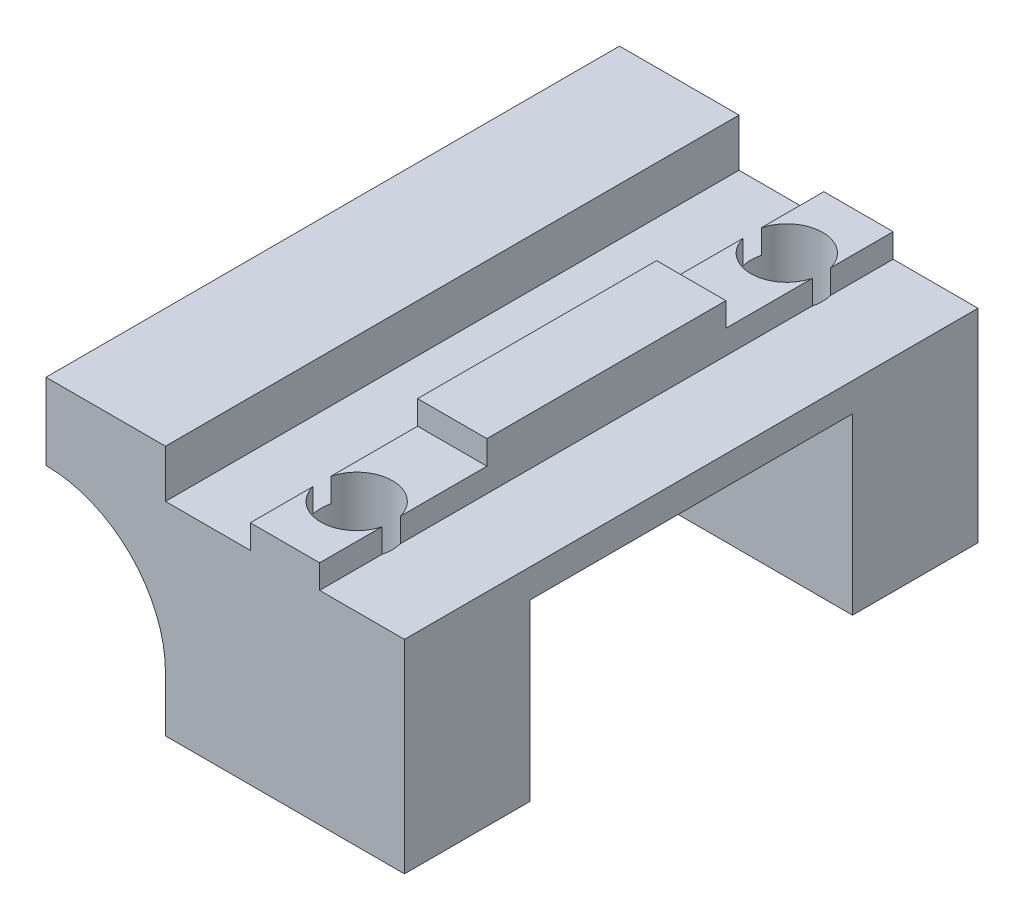
ISO-10303-21;
HEADER;
FILE_DESCRIPTION(('STEP AP214'),'2;1');
FILE_NAME('part.step','',(''),(''),'','','');
FILE_SCHEMA(('AUTOMOTIVE_DESIGN { 1 0 10303 214 1 1 1 1 }'));
ENDSEC;
DATA;
#1=APPLICATION_CONTEXT('core data for automotive mechanical design processes');
#2=APPLICATION_PROTOCOL_DEFINITION('international standard','automotive_design',2000,#1);
#3=PRODUCT_CONTEXT('',#1,'mechanical');
#4=PRODUCT('Part','Part','',(#3));
#5=PRODUCT_RELATED_PRODUCT_CATEGORY('part','',(#4));
#6=PRODUCT_DEFINITION_FORMATION('','',#4);
#7=PRODUCT_DEFINITION_CONTEXT('part definition',#1,'design');
#8=PRODUCT_DEFINITION('design','',#6,#7);
#9=PRODUCT_DEFINITION_SHAPE('','',#8);
#10=(LENGTH_UNIT() NAMED_UNIT(*) SI_UNIT(.MILLI.,.METRE.));
#11=(NAMED_UNIT(*) PLANE_ANGLE_UNIT() SI_UNIT($,.RADIAN.));
#12=(NAMED_UNIT(*) SI_UNIT($,.STERADIAN.) SOLID_ANGLE_UNIT());
#13=UNCERTAINTY_MEASURE_WITH_UNIT(LENGTH_MEASURE(1.E-05),#10,'distance_accuracy_value','');
#14=(GEOMETRIC_REPRESENTATION_CONTEXT(3) GLOBAL_UNCERTAINTY_ASSIGNED_CONTEXT((#13)) GLOBAL_UNIT_ASSIGNED_CONTEXT((#10,
#11,#12)) REPRESENTATION_CONTEXT('',''));
#15=CARTESIAN_POINT('',(0.,0.,0.));
#16=DIRECTION('',(0.,0.,1.));
#17=DIRECTION('',(1.,0.,0.));
#18=AXIS2_PLACEMENT_3D('',#15,#16,#17);
#19=CARTESIAN_POINT('',(-1.45,10.5,12.));
#20=DIRECTION('',(1.,0.,0.));
#21=DIRECTION('',(0.,1.,0.));
#22=AXIS2_PLACEMENT_3D('',#19,#20,#21);
#23=PLANE('',#22);
#24=DIRECTION('',(0.,0.,1.));
#25=VECTOR('',#24,1.);
#26=CARTESIAN_POINT('',(-1.45,9.5,-12.));
#27=LINE('',#26,#25);
#28=CARTESIAN_POINT('',(-1.45,9.5,-12.));
#29=VERTEX_POINT('',#28);
#30=CARTESIAN_POINT('',(-1.45,9.5,-9.38405728739343));
#31=VERTEX_POINT('',#30);
#32=EDGE_CURVE('E472',#29,#31,#27,.T.);
#33=ORIENTED_EDGE('',*,*,#32,.F.);
#34=DIRECTION('',(0.,-1.,0.));
#35=VECTOR('',#34,1.);
#36=CARTESIAN_POINT('',(-1.45,10.5,-12.));
#37=LINE('',#36,#35);
#38=CARTESIAN_POINT('',(-1.45,8.5,-12.));
#39=VERTEX_POINT('',#38);
#40=EDGE_CURVE('E293',#29,#39,#37,.T.);
#41=ORIENTED_EDGE('',*,*,#40,.T.);
#42=DIRECTION('',(0.,0.,-1.));
#43=VECTOR('',#42,1.);
#44=CARTESIAN_POINT('',(-1.45,8.5,12.));
#45=LINE('',#44,#43);
#46=CARTESIAN_POINT('',(-1.45,8.5,-9.38405728739343));
#47=VERTEX_POINT('',#46);
#48=EDGE_CURVE('E306',#47,#39,#45,.T.);
#49=ORIENTED_EDGE('',*,*,#48,.F.);
#50=DIRECTION('',(0.,1.,0.));
#51=VECTOR('',#50,1.);
#52=CARTESIAN_POINT('',(-1.45,0.,-9.38405728739343));
#53=LINE('',#52,#51);
#54=EDGE_CURVE('E420',#47,#31,#53,.T.);
#55=ORIENTED_EDGE('',*,*,#54,.T.);
#56=EDGE_LOOP('',(#33,#41,#49,#55));
#57=FACE_BOUND('',#56,.T.);
#58=ADVANCED_FACE('F33',(#57),#23,.F.);
#59=CARTESIAN_POINT('',(1.45,8.5,12.));
#60=DIRECTION('',(-1.,0.,0.));
#61=DIRECTION('',(0.,-1.,0.));
#62=AXIS2_PLACEMENT_3D('',#59,#60,#61);
#63=PLANE('',#62);
#64=DIRECTION('',(0.,0.,-1.));
#65=VECTOR('',#64,1.);
#66=CARTESIAN_POINT('',(1.45,9.5,-12.));
#67=LINE('',#66,#65);
#68=CARTESIAN_POINT('',(1.45,9.5,-9.38405728739343));
#69=VERTEX_POINT('',#68);
#70=CARTESIAN_POINT('',(1.45,9.5,-12.));
#71=VERTEX_POINT('',#70);
#72=EDGE_CURVE('E478',#69,#71,#67,.T.);
#73=ORIENTED_EDGE('',*,*,#72,.F.);
#74=DIRECTION('',(0.,1.,0.));
#75=VECTOR('',#74,1.);
#76=CARTESIAN_POINT('',(1.45,0.,-9.38405728739343));
#77=LINE('',#76,#75);
#78=CARTESIAN_POINT('',(1.45,8.5,-9.38405728739343));
#79=VERTEX_POINT('',#78);
#80=EDGE_CURVE('E423',#69,#79,#77,.F.);
#81=ORIENTED_EDGE('',*,*,#80,.T.);
#82=DIRECTION('',(0.,0.,-1.));
#83=VECTOR('',#82,1.);
#84=CARTESIAN_POINT('',(1.45,8.5,12.));
#85=LINE('',#84,#83);
#86=CARTESIAN_POINT('',(1.45,8.5,-12.));
#87=VERTEX_POINT('',#86);
#88=EDGE_CURVE('E313',#79,#87,#85,.T.);
#89=ORIENTED_EDGE('',*,*,#88,.T.);
#90=DIRECTION('',(0.,1.,0.));
#91=VECTOR('',#90,1.);
#92=CARTESIAN_POINT('',(1.45,8.5,-12.));
#93=LINE('',#92,#91);
#94=EDGE_CURVE('E290',#87,#71,#93,.T.);
#95=ORIENTED_EDGE('',*,*,#94,.T.);
#96=EDGE_LOOP('',(#73,#81,#89,#95));
#97=FACE_BOUND('',#96,.T.);
#98=ADVANCED_FACE('F549',(#97),#63,.F.);
#99=CARTESIAN_POINT('',(0.,0.,-12.));
#100=DIRECTION('',(0.,0.,1.));
#101=DIRECTION('',(1.,0.,0.));
#102=AXIS2_PLACEMENT_3D('',#99,#100,#101);
#103=PLANE('',#102);
#104=DIRECTION('',(-1.,0.,0.));
#105=VECTOR('',#104,1.);
#106=CARTESIAN_POINT('',(-1.45,9.5,-12.));
#107=LINE('',#106,#105);
#108=EDGE_CURVE('E481',#71,#29,#107,.T.);
#109=ORIENTED_EDGE('',*,*,#108,.F.);
#110=ORIENTED_EDGE('',*,*,#94,.F.);
#111=DIRECTION('',(-1.,0.,0.));
#112=VECTOR('',#111,1.);
#113=CARTESIAN_POINT('',(5.,8.5,-12.));
#114=LINE('',#113,#112);
#115=CARTESIAN_POINT('',(5.,8.5,-12.));
#116=VERTEX_POINT('',#115);
#117=EDGE_CURVE('E287',#116,#87,#114,.T.);
#118=ORIENTED_EDGE('',*,*,#117,.F.);
#119=DIRECTION('',(0.,1.,0.));
#120=VECTOR('',#119,1.);
#121=CARTESIAN_POINT('',(5.,0.,-12.));
#122=LINE('',#121,#120);
#123=CARTESIAN_POINT('',(5.,0.,-12.));
#124=VERTEX_POINT('',#123);
#125=EDGE_CURVE('E284',#124,#116,#122,.T.);
#126=ORIENTED_EDGE('',*,*,#125,.F.);
#127=DIRECTION('',(1.,0.,0.));
#128=VECTOR('',#127,1.);
#129=CARTESIAN_POINT('',(-5.,0.,-12.));
#130=LINE('',#129,#128);
#131=CARTESIAN_POINT('',(-5.,0.,-12.));
#132=VERTEX_POINT('',#131);
#133=EDGE_CURVE('E281',#132,#124,#130,.T.);
#134=ORIENTED_EDGE('',*,*,#133,.F.);
#135=DIRECTION('',(0.,-1.,0.));
#136=VECTOR('',#135,1.);
#137=CARTESIAN_POINT('',(-5.,8.5,-12.));
#138=LINE('',#137,#136);
#139=CARTESIAN_POINT('',(-5.,2.3,-12.));
#140=VERTEX_POINT('',#139);
#141=EDGE_CURVE('E297',#140,#132,#138,.T.);
#142=ORIENTED_EDGE('',*,*,#141,.F.);
#143=CARTESIAN_POINT('',(-10.,2.3,-12.));
#144=DIRECTION('',(0.,0.,1.));
#145=DIRECTION('',(1.,0.,0.));
#146=AXIS2_PLACEMENT_3D('',#143,#144,#145);
#147=CIRCLE('',#146,5.);
#148=CARTESIAN_POINT('',(-10.,7.3,-12.));
#149=VERTEX_POINT('',#148);
#150=EDGE_CURVE('E342',#140,#149,#147,.T.);
#151=ORIENTED_EDGE('',*,*,#150,.T.);
#152=DIRECTION('',(0.,-1.,0.));
#153=VECTOR('',#152,1.);
#154=CARTESIAN_POINT('',(-10.,35.0153013442625,-12.));
#155=LINE('',#154,#153);
#156=CARTESIAN_POINT('',(-10.,10.5,-12.));
#157=VERTEX_POINT('',#156);
#158=EDGE_CURVE('E351',#157,#149,#155,.T.);
#159=ORIENTED_EDGE('',*,*,#158,.F.);
#160=DIRECTION('',(-1.,0.,0.));
#161=VECTOR('',#160,1.);
#162=CARTESIAN_POINT('',(-5.00000000000001,10.5,-12.));
#163=LINE('',#162,#161);
#164=CARTESIAN_POINT('',(-5.,10.5,-12.));
#165=VERTEX_POINT('',#164);
#166=EDGE_CURVE('E521',#165,#157,#163,.T.);
#167=ORIENTED_EDGE('',*,*,#166,.F.);
#168=DIRECTION('',(0.,-1.,0.));
#169=VECTOR('',#168,1.);
#170=CARTESIAN_POINT('',(-5.00000000000001,35.0153013442625,-12.));
#171=LINE('',#170,#169);
#172=CARTESIAN_POINT('',(-5.,8.5,-12.));
#173=VERTEX_POINT('',#172);
#174=EDGE_CURVE('E365',#165,#173,#171,.T.);
#175=ORIENTED_EDGE('',*,*,#174,.T.);
#176=DIRECTION('',(-1.,0.,0.));
#177=VECTOR('',#176,1.);
#178=CARTESIAN_POINT('',(-1.45,8.5,-12.));
#179=LINE('',#178,#177);
#180=EDGE_CURVE('E295',#39,#173,#179,.T.);
#181=ORIENTED_EDGE('',*,*,#180,.F.);
#182=ORIENTED_EDGE('',*,*,#40,.F.);
#183=EDGE_LOOP('',(#109,#110,#118,#126,#134,#142,#151,#159,#167,#175,#181,#182));
#184=FACE_BOUND('',#183,.T.);
#185=ADVANCED_FACE('F349',(#184),#103,.F.);
#186=CARTESIAN_POINT('',(0.,0.,-9.));
#187=DIRECTION('',(0.,1.,0.));
#188=DIRECTION('',(0.,0.,1.));
#189=AXIS2_PLACEMENT_3D('',#186,#187,#188);
#190=CYLINDRICAL_SURFACE('',#189,1.5);
#191=CARTESIAN_POINT('',(0.,0.,-9.));
#192=DIRECTION('',(0.,1.,0.));
#193=DIRECTION('',(0.,0.,1.));
#194=AXIS2_PLACEMENT_3D('',#191,#192,#193);
#195=CIRCLE('',#194,1.5);
#196=CARTESIAN_POINT('',(0.,0.,-7.5));
#197=VERTEX_POINT('',#196);
#198=EDGE_CURVE('E410',#197,#197,#195,.T.);
#199=ORIENTED_EDGE('',*,*,#198,.F.);
#200=EDGE_LOOP('',(#199));
#201=FACE_BOUND('',#200,.T.);
#202=CARTESIAN_POINT('',(0.,9.5,-9.));
#203=DIRECTION('',(0.,1.,0.));
#204=DIRECTION('',(0.,0.,1.));
#205=AXIS2_PLACEMENT_3D('',#202,#203,#204);
#206=CIRCLE('',#205,1.5);
#207=EDGE_CURVE('E333',#31,#69,#206,.F.);
#208=ORIENTED_EDGE('',*,*,#207,.F.);
#209=ORIENTED_EDGE('',*,*,#54,.F.);
#210=CARTESIAN_POINT('',(0.,8.5,-9.));
#211=DIRECTION('',(0.,-1.,0.));
#212=DIRECTION('',(1.,0.,0.));
#213=AXIS2_PLACEMENT_3D('',#210,#211,#212);
#214=CIRCLE('',#213,1.5);
#215=CARTESIAN_POINT('',(-1.45,8.5,-8.61594271260657));
#216=VERTEX_POINT('',#215);
#217=EDGE_CURVE('E328',#216,#47,#214,.T.);
#218=ORIENTED_EDGE('',*,*,#217,.F.);
#219=DIRECTION('',(0.,1.,0.));
#220=VECTOR('',#219,1.);
#221=CARTESIAN_POINT('',(-1.45,0.,-8.61594271260657));
#222=LINE('',#221,#220);
#223=CARTESIAN_POINT('',(-1.45,9.5,-8.61594271260657));
#224=VERTEX_POINT('',#223);
#225=EDGE_CURVE('E418',#224,#216,#222,.F.);
#226=ORIENTED_EDGE('',*,*,#225,.F.);
#227=CARTESIAN_POINT('',(1.45,9.5,-8.61594271260657));
#228=VERTEX_POINT('',#227);
#229=EDGE_CURVE('E331',#228,#224,#206,.F.);
#230=ORIENTED_EDGE('',*,*,#229,.F.);
#231=DIRECTION('',(0.,1.,0.));
#232=VECTOR('',#231,1.);
#233=CARTESIAN_POINT('',(1.45,0.,-8.61594271260657));
#234=LINE('',#233,#232);
#235=CARTESIAN_POINT('',(1.45,8.5,-8.61594271260657));
#236=VERTEX_POINT('',#235);
#237=EDGE_CURVE('E428',#236,#228,#234,.T.);
#238=ORIENTED_EDGE('',*,*,#237,.F.);
#239=CARTESIAN_POINT('',(0.,8.5,-9.));
#240=DIRECTION('',(0.,-1.,0.));
#241=DIRECTION('',(0.,0.,-1.));
#242=AXIS2_PLACEMENT_3D('',#239,#240,#241);
#243=CIRCLE('',#242,1.5);
#244=EDGE_CURVE('E425',#79,#236,#243,.T.);
#245=ORIENTED_EDGE('',*,*,#244,.F.);
#246=ORIENTED_EDGE('',*,*,#80,.F.);
#247=EDGE_LOOP('',(#208,#209,#218,#226,#230,#238,#245,#246));
#248=FACE_BOUND('',#247,.T.);
#249=ADVANCED_FACE('F545',(#201,#248),#190,.F.);
#250=CARTESIAN_POINT('',(-5.,8.5,12.));
#251=DIRECTION('',(1.,0.,0.));
#252=DIRECTION('',(0.,1.,0.));
#253=AXIS2_PLACEMENT_3D('',#250,#251,#252);
#254=PLANE('',#253);
#255=DIRECTION('',(0.,-1.,0.));
#256=VECTOR('',#255,1.);
#257=CARTESIAN_POINT('',(-5.,7.3,-6.75));
#258=LINE('',#257,#256);
#259=CARTESIAN_POINT('',(-5.,2.3,-6.75));
#260=VERTEX_POINT('',#259);
#261=CARTESIAN_POINT('',(-5.,0.,-6.75));
#262=VERTEX_POINT('',#261);
#263=EDGE_CURVE('E411',#260,#262,#258,.T.);
#264=ORIENTED_EDGE('',*,*,#263,.F.);
#265=DIRECTION('',(0.,0.,1.));
#266=VECTOR('',#265,1.);
#267=CARTESIAN_POINT('',(-5.,2.3,-12.));
#268=LINE('',#267,#266);
#269=EDGE_CURVE('E337',#260,#140,#268,.F.);
#270=ORIENTED_EDGE('',*,*,#269,.T.);
#271=ORIENTED_EDGE('',*,*,#141,.T.);
#272=DIRECTION('',(0.,0.,-1.));
#273=VECTOR('',#272,1.);
#274=CARTESIAN_POINT('',(-5.,0.,12.));
#275=LINE('',#274,#273);
#276=EDGE_CURVE('E280',#262,#132,#275,.T.);
#277=ORIENTED_EDGE('',*,*,#276,.F.);
#278=EDGE_LOOP('',(#264,#270,#271,#277));
#279=FACE_BOUND('',#278,.T.);
#280=ADVANCED_FACE('F563',(#279),#254,.F.);
#281=DIRECTION('',(0.,-1.,0.));
#282=VECTOR('',#281,1.);
#283=CARTESIAN_POINT('',(-5.,8.5,12.));
#284=LINE('',#283,#282);
#285=CARTESIAN_POINT('',(-5.,2.3,12.));
#286=VERTEX_POINT('',#285);
#287=CARTESIAN_POINT('',(-5.,0.,12.));
#288=VERTEX_POINT('',#287);
#289=EDGE_CURVE('E273',#286,#288,#284,.T.);
#290=ORIENTED_EDGE('',*,*,#289,.F.);
#291=DIRECTION('',(0.,0.,1.));
#292=VECTOR('',#291,1.);
#293=CARTESIAN_POINT('',(-5.,2.3,6.75));
#294=LINE('',#293,#292);
#295=CARTESIAN_POINT('',(-5.,2.3,6.75));
#296=VERTEX_POINT('',#295);
#297=EDGE_CURVE('E54',#286,#296,#294,.F.);
#298=ORIENTED_EDGE('',*,*,#297,.T.);
#299=DIRECTION('',(0.,-1.,0.));
#300=VECTOR('',#299,1.);
#301=CARTESIAN_POINT('',(-5.,7.3,6.75));
#302=LINE('',#301,#300);
#303=CARTESIAN_POINT('',(-5.,0.,6.75));
#304=VERTEX_POINT('',#303);
#305=EDGE_CURVE('E413',#296,#304,#302,.T.);
#306=ORIENTED_EDGE('',*,*,#305,.T.);
#307=EDGE_CURVE('E300',#288,#304,#275,.T.);
#308=ORIENTED_EDGE('',*,*,#307,.F.);
#309=EDGE_LOOP('',(#290,#298,#306,#308));
#310=FACE_BOUND('',#309,.T.);
#311=ADVANCED_FACE('F577',(#310),#254,.F.);
#312=CARTESIAN_POINT('',(-5.,0.,12.));
#313=DIRECTION('',(0.,1.,0.));
#314=DIRECTION('',(-1.,0.,0.));
#315=AXIS2_PLACEMENT_3D('',#312,#313,#314);
#316=PLANE('',#315);
#317=ORIENTED_EDGE('',*,*,#198,.T.);
#318=EDGE_LOOP('',(#317));
#319=FACE_BOUND('',#318,.T.);
#320=DIRECTION('',(0.,0.,-1.));
#321=VECTOR('',#320,1.);
#322=CARTESIAN_POINT('',(5.,0.,12.));
#323=LINE('',#322,#321);
#324=CARTESIAN_POINT('',(5.,0.,-6.75));
#325=VERTEX_POINT('',#324);
#326=EDGE_CURVE('E321',#325,#124,#323,.T.);
#327=ORIENTED_EDGE('',*,*,#326,.F.);
#328=DIRECTION('',(1.,0.,0.));
#329=VECTOR('',#328,1.);
#330=CARTESIAN_POINT('',(5.,0.,-6.75));
#331=LINE('',#330,#329);
#332=EDGE_CURVE('E398',#262,#325,#331,.T.);
#333=ORIENTED_EDGE('',*,*,#332,.F.);
#334=ORIENTED_EDGE('',*,*,#276,.T.);
#335=ORIENTED_EDGE('',*,*,#133,.T.);
#336=EDGE_LOOP('',(#327,#333,#334,#335));
#337=FACE_BOUND('',#336,.T.);
#338=ADVANCED_FACE('F558',(#319,#337),#316,.F.);
#339=DIRECTION('',(0.,0.,-1.));
#340=VECTOR('',#339,1.);
#341=CARTESIAN_POINT('',(1.45,10.5,12.));
#342=LINE('',#341,#340);
#343=CARTESIAN_POINT('',(1.45,10.5,5.));
#344=VERTEX_POINT('',#343);
#345=CARTESIAN_POINT('',(1.45,10.5,-5.));
#346=VERTEX_POINT('',#345);
#347=EDGE_CURVE('E311',#344,#346,#342,.T.);
#348=ORIENTED_EDGE('',*,*,#347,.F.);
#349=DIRECTION('',(0.,1.,0.));
#350=VECTOR('',#349,1.);
#351=CARTESIAN_POINT('',(1.45,9.5,5.));
#352=LINE('',#351,#350);
#353=CARTESIAN_POINT('',(1.45,9.5,5.));
#354=VERTEX_POINT('',#353);
#355=EDGE_CURVE('E463',#354,#344,#352,.T.);
#356=ORIENTED_EDGE('',*,*,#355,.F.);
#357=DIRECTION('',(0.,0.,-1.));
#358=VECTOR('',#357,1.);
#359=CARTESIAN_POINT('',(1.45,9.5,12.));
#360=LINE('',#359,#358);
#361=CARTESIAN_POINT('',(1.45,9.5,8.61594271260656));
#362=VERTEX_POINT('',#361);
#363=EDGE_CURVE('E265',#362,#354,#360,.T.);
#364=ORIENTED_EDGE('',*,*,#363,.F.);
#365=DIRECTION('',(0.,1.,0.));
#366=VECTOR('',#365,1.);
#367=CARTESIAN_POINT('',(1.45,0.,8.61594271260657));
#368=LINE('',#367,#366);
#369=CARTESIAN_POINT('',(1.45,8.5,8.61594271260657));
#370=VERTEX_POINT('',#369);
#371=EDGE_CURVE('E439',#362,#370,#368,.F.);
#372=ORIENTED_EDGE('',*,*,#371,.T.);
#373=EDGE_CURVE('E318',#370,#236,#85,.T.);
#374=ORIENTED_EDGE('',*,*,#373,.T.);
#375=ORIENTED_EDGE('',*,*,#237,.T.);
#376=CARTESIAN_POINT('',(1.45,9.5,-5.));
#377=VERTEX_POINT('',#376);
#378=EDGE_CURVE('E479',#377,#228,#67,.T.);
#379=ORIENTED_EDGE('',*,*,#378,.F.);
#380=DIRECTION('',(0.,1.,0.));
#381=VECTOR('',#380,1.);
#382=CARTESIAN_POINT('',(1.45,9.5,-5.));
#383=LINE('',#382,#381);
#384=EDGE_CURVE('E486',#377,#346,#383,.T.);
#385=ORIENTED_EDGE('',*,*,#384,.T.);
#386=EDGE_LOOP('',(#348,#356,#364,#372,#374,#375,#379,#385));
#387=FACE_BOUND('',#386,.T.);
#388=ADVANCED_FACE('F589',(#387),#63,.F.);
#389=CARTESIAN_POINT('',(1.45,10.5,12.));
#390=DIRECTION('',(0.,-1.,0.));
#391=DIRECTION('',(0.,0.,-1.));
#392=AXIS2_PLACEMENT_3D('',#389,#390,#391);
#393=PLANE('',#392);
#394=DIRECTION('',(0.,0.,-1.));
#395=VECTOR('',#394,1.);
#396=CARTESIAN_POINT('',(-1.45,10.5,12.));
#397=LINE('',#396,#395);
#398=CARTESIAN_POINT('',(-1.45,10.5,5.));
#399=VERTEX_POINT('',#398);
#400=CARTESIAN_POINT('',(-1.45,10.5,-5.));
#401=VERTEX_POINT('',#400);
#402=EDGE_CURVE('E308',#399,#401,#397,.T.);
#403=ORIENTED_EDGE('',*,*,#402,.F.);
#404=DIRECTION('',(-1.,0.,0.));
#405=VECTOR('',#404,1.);
#406=CARTESIAN_POINT('',(-1.45,10.5,5.));
#407=LINE('',#406,#405);
#408=EDGE_CURVE('E257',#344,#399,#407,.T.);
#409=ORIENTED_EDGE('',*,*,#408,.F.);
#410=ORIENTED_EDGE('',*,*,#347,.T.);
#411=DIRECTION('',(1.,0.,0.));
#412=VECTOR('',#411,1.);
#413=CARTESIAN_POINT('',(-1.45,10.5,-5.));
#414=LINE('',#413,#412);
#415=EDGE_CURVE('E470',#401,#346,#414,.T.);
#416=ORIENTED_EDGE('',*,*,#415,.F.);
#417=EDGE_LOOP('',(#403,#409,#410,#416));
#418=FACE_BOUND('',#417,.T.);
#419=ADVANCED_FACE('F615',(#418),#393,.F.);
#420=DIRECTION('',(0.,1.,0.));
#421=VECTOR('',#420,1.);
#422=CARTESIAN_POINT('',(1.45,0.,9.38405728739344));
#423=LINE('',#422,#421);
#424=CARTESIAN_POINT('',(1.45,8.5,9.38405728739344));
#425=VERTEX_POINT('',#424);
#426=CARTESIAN_POINT('',(1.45,9.5,9.38405728739344));
#427=VERTEX_POINT('',#426);
#428=EDGE_CURVE('E285',#425,#427,#423,.T.);
#429=ORIENTED_EDGE('',*,*,#428,.T.);
#430=CARTESIAN_POINT('',(1.45,9.5,12.));
#431=VERTEX_POINT('',#430);
#432=EDGE_CURVE('E459',#431,#427,#360,.T.);
#433=ORIENTED_EDGE('',*,*,#432,.F.);
#434=DIRECTION('',(0.,1.,0.));
#435=VECTOR('',#434,1.);
#436=CARTESIAN_POINT('',(1.45,8.5,12.));
#437=LINE('',#436,#435);
#438=CARTESIAN_POINT('',(1.45,8.5,12.));
#439=VERTEX_POINT('',#438);
#440=EDGE_CURVE('E264',#439,#431,#437,.T.);
#441=ORIENTED_EDGE('',*,*,#440,.F.);
#442=EDGE_CURVE('E314',#439,#425,#85,.T.);
#443=ORIENTED_EDGE('',*,*,#442,.T.);
#444=EDGE_LOOP('',(#429,#433,#441,#443));
#445=FACE_BOUND('',#444,.T.);
#446=ADVANCED_FACE('F458',(#445),#63,.F.);
#447=DIRECTION('',(0.,0.,1.));
#448=VECTOR('',#447,1.);
#449=CARTESIAN_POINT('',(-1.45,9.5,12.));
#450=LINE('',#449,#448);
#451=CARTESIAN_POINT('',(-1.45,9.5,5.));
#452=VERTEX_POINT('',#451);
#453=CARTESIAN_POINT('',(-1.45,9.5,8.61594271260657));
#454=VERTEX_POINT('',#453);
#455=EDGE_CURVE('E256',#452,#454,#450,.T.);
#456=ORIENTED_EDGE('',*,*,#455,.F.);
#457=DIRECTION('',(0.,1.,0.));
#458=VECTOR('',#457,1.);
#459=CARTESIAN_POINT('',(-1.45,9.5,5.));
#460=LINE('',#459,#458);
#461=EDGE_CURVE('E467',#452,#399,#460,.T.);
#462=ORIENTED_EDGE('',*,*,#461,.T.);
#463=ORIENTED_EDGE('',*,*,#402,.T.);
#464=DIRECTION('',(0.,1.,0.));
#465=VECTOR('',#464,1.);
#466=CARTESIAN_POINT('',(-1.45,9.5,-5.));
#467=LINE('',#466,#465);
#468=CARTESIAN_POINT('',(-1.45,9.5,-5.));
#469=VERTEX_POINT('',#468);
#470=EDGE_CURVE('E483',#469,#401,#467,.T.);
#471=ORIENTED_EDGE('',*,*,#470,.F.);
#472=EDGE_CURVE('E475',#224,#469,#27,.T.);
#473=ORIENTED_EDGE('',*,*,#472,.F.);
#474=ORIENTED_EDGE('',*,*,#225,.T.);
#475=CARTESIAN_POINT('',(-1.45,8.5,8.61594271260656));
#476=VERTEX_POINT('',#475);
#477=EDGE_CURVE('E309',#476,#216,#45,.T.);
#478=ORIENTED_EDGE('',*,*,#477,.F.);
#479=DIRECTION('',(0.,1.,0.));
#480=VECTOR('',#479,1.);
#481=CARTESIAN_POINT('',(-1.45,0.,8.61594271260657));
#482=LINE('',#481,#480);
#483=EDGE_CURVE('E436',#476,#454,#482,.T.);
#484=ORIENTED_EDGE('',*,*,#483,.T.);
#485=EDGE_LOOP('',(#456,#462,#463,#471,#473,#474,#478,#484));
#486=FACE_BOUND('',#485,.T.);
#487=ADVANCED_FACE('F584',(#486),#23,.F.);
#488=CARTESIAN_POINT('',(0.,0.,9.));
#489=DIRECTION('',(0.,1.,0.));
#490=DIRECTION('',(0.,0.,1.));
#491=AXIS2_PLACEMENT_3D('',#488,#489,#490);
#492=CIRCLE('',#491,1.5);
#493=CARTESIAN_POINT('',(0.,0.,10.5));
#494=VERTEX_POINT('',#493);
#495=EDGE_CURVE('E431',#494,#494,#492,.T.);
#496=ORIENTED_EDGE('',*,*,#495,.T.);
#497=EDGE_LOOP('',(#496));
#498=FACE_BOUND('',#497,.T.);
#499=ORIENTED_EDGE('',*,*,#307,.T.);
#500=DIRECTION('',(-1.,0.,0.));
#501=VECTOR('',#500,1.);
#502=CARTESIAN_POINT('',(5.,0.,6.75));
#503=LINE('',#502,#501);
#504=CARTESIAN_POINT('',(5.,0.,6.75));
#505=VERTEX_POINT('',#504);
#506=EDGE_CURVE('E392',#505,#304,#503,.T.);
#507=ORIENTED_EDGE('',*,*,#506,.F.);
#508=CARTESIAN_POINT('',(5.,0.,12.));
#509=VERTEX_POINT('',#508);
#510=EDGE_CURVE('E322',#509,#505,#323,.T.);
#511=ORIENTED_EDGE('',*,*,#510,.F.);
#512=DIRECTION('',(1.,0.,0.));
#513=VECTOR('',#512,1.);
#514=CARTESIAN_POINT('',(-5.,0.,12.));
#515=LINE('',#514,#513);
#516=EDGE_CURVE('E299',#288,#509,#515,.T.);
#517=ORIENTED_EDGE('',*,*,#516,.F.);
#518=EDGE_LOOP('',(#499,#507,#511,#517));
#519=FACE_BOUND('',#518,.T.);
#520=ADVANCED_FACE('F574',(#498,#519),#316,.F.);
#521=CARTESIAN_POINT('',(5.,0.,12.));
#522=DIRECTION('',(-1.,0.,0.));
#523=DIRECTION('',(0.,-1.,0.));
#524=AXIS2_PLACEMENT_3D('',#521,#522,#523);
#525=PLANE('',#524);
#526=DIRECTION('',(0.,0.,1.));
#527=VECTOR('',#526,1.);
#528=CARTESIAN_POINT('',(5.,7.3,6.75));
#529=LINE('',#528,#527);
#530=CARTESIAN_POINT('',(5.,7.3,-6.75));
#531=VERTEX_POINT('',#530);
#532=CARTESIAN_POINT('',(5.,7.3,6.75));
#533=VERTEX_POINT('',#532);
#534=EDGE_CURVE('E394',#531,#533,#529,.T.);
#535=ORIENTED_EDGE('',*,*,#534,.F.);
#536=DIRECTION('',(0.,-1.,0.));
#537=VECTOR('',#536,1.);
#538=CARTESIAN_POINT('',(5.,7.3,-6.75));
#539=LINE('',#538,#537);
#540=EDGE_CURVE('E407',#531,#325,#539,.T.);
#541=ORIENTED_EDGE('',*,*,#540,.T.);
#542=ORIENTED_EDGE('',*,*,#326,.T.);
#543=ORIENTED_EDGE('',*,*,#125,.T.);
#544=DIRECTION('',(0.,0.,-1.));
#545=VECTOR('',#544,1.);
#546=CARTESIAN_POINT('',(5.,8.5,12.));
#547=LINE('',#546,#545);
#548=CARTESIAN_POINT('',(5.,8.5,12.));
#549=VERTEX_POINT('',#548);
#550=EDGE_CURVE('E317',#549,#116,#547,.T.);
#551=ORIENTED_EDGE('',*,*,#550,.F.);
#552=DIRECTION('',(0.,1.,0.));
#553=VECTOR('',#552,1.);
#554=CARTESIAN_POINT('',(5.,0.,12.));
#555=LINE('',#554,#553);
#556=EDGE_CURVE('E448',#509,#549,#555,.T.);
#557=ORIENTED_EDGE('',*,*,#556,.F.);
#558=ORIENTED_EDGE('',*,*,#510,.T.);
#559=DIRECTION('',(0.,-1.,0.));
#560=VECTOR('',#559,1.);
#561=CARTESIAN_POINT('',(5.,7.3,6.75));
#562=LINE('',#561,#560);
#563=EDGE_CURVE('E403',#533,#505,#562,.T.);
#564=ORIENTED_EDGE('',*,*,#563,.F.);
#565=EDGE_LOOP('',(#535,#541,#542,#543,#551,#557,#558,#564));
#566=FACE_BOUND('',#565,.T.);
#567=ADVANCED_FACE('F554',(#566),#525,.F.);
#568=CARTESIAN_POINT('',(5.,8.5,12.));
#569=DIRECTION('',(0.,-1.,0.));
#570=DIRECTION('',(0.,0.,-1.));
#571=AXIS2_PLACEMENT_3D('',#568,#569,#570);
#572=PLANE('',#571);
#573=ORIENTED_EDGE('',*,*,#88,.F.);
#574=ORIENTED_EDGE('',*,*,#244,.T.);
#575=ORIENTED_EDGE('',*,*,#373,.F.);
#576=CARTESIAN_POINT('',(0.,8.5,9.));
#577=DIRECTION('',(0.,-1.,0.));
#578=DIRECTION('',(0.,0.,-1.));
#579=AXIS2_PLACEMENT_3D('',#576,#577,#578);
#580=CIRCLE('',#579,1.5);
#581=EDGE_CURVE('E441',#370,#425,#580,.T.);
#582=ORIENTED_EDGE('',*,*,#581,.T.);
#583=ORIENTED_EDGE('',*,*,#442,.F.);
#584=DIRECTION('',(-1.,0.,0.));
#585=VECTOR('',#584,1.);
#586=CARTESIAN_POINT('',(5.,8.5,12.));
#587=LINE('',#586,#585);
#588=EDGE_CURVE('E275',#549,#439,#587,.T.);
#589=ORIENTED_EDGE('',*,*,#588,.F.);
#590=ORIENTED_EDGE('',*,*,#550,.T.);
#591=ORIENTED_EDGE('',*,*,#117,.T.);
#592=EDGE_LOOP('',(#573,#574,#575,#582,#583,#589,#590,#591));
#593=FACE_BOUND('',#592,.T.);
#594=ADVANCED_FACE('F454',(#593),#572,.F.);
#595=DIRECTION('',(0.,-1.,0.));
#596=VECTOR('',#595,1.);
#597=CARTESIAN_POINT('',(-1.45,10.5,12.));
#598=LINE('',#597,#596);
#599=CARTESIAN_POINT('',(-1.45,9.5,12.));
#600=VERTEX_POINT('',#599);
#601=CARTESIAN_POINT('',(-1.45,8.5,12.));
#602=VERTEX_POINT('',#601);
#603=EDGE_CURVE('E261',#600,#602,#598,.T.);
#604=ORIENTED_EDGE('',*,*,#603,.F.);
#605=CARTESIAN_POINT('',(-1.45,9.5,9.38405728739345));
#606=VERTEX_POINT('',#605);
#607=EDGE_CURVE('E246',#606,#600,#450,.T.);
#608=ORIENTED_EDGE('',*,*,#607,.F.);
#609=DIRECTION('',(0.,1.,0.));
#610=VECTOR('',#609,1.);
#611=CARTESIAN_POINT('',(-1.45,0.,9.38405728739344));
#612=LINE('',#611,#610);
#613=CARTESIAN_POINT('',(-1.45,8.5,9.38405728739344));
#614=VERTEX_POINT('',#613);
#615=EDGE_CURVE('E434',#606,#614,#612,.F.);
#616=ORIENTED_EDGE('',*,*,#615,.T.);
#617=EDGE_CURVE('E269',#602,#614,#45,.T.);
#618=ORIENTED_EDGE('',*,*,#617,.F.);
#619=EDGE_LOOP('',(#604,#608,#616,#618));
#620=FACE_BOUND('',#619,.T.);
#621=ADVANCED_FACE('F267',(#620),#23,.F.);
#622=CARTESIAN_POINT('',(-1.45,8.5,12.));
#623=DIRECTION('',(0.,-1.,0.));
#624=DIRECTION('',(1.,0.,0.));
#625=AXIS2_PLACEMENT_3D('',#622,#623,#624);
#626=PLANE('',#625);
#627=ORIENTED_EDGE('',*,*,#477,.T.);
#628=ORIENTED_EDGE('',*,*,#217,.T.);
#629=ORIENTED_EDGE('',*,*,#48,.T.);
#630=ORIENTED_EDGE('',*,*,#180,.T.);
#631=DIRECTION('',(0.,0.,-1.));
#632=VECTOR('',#631,1.);
#633=CARTESIAN_POINT('',(-5.,8.5,12.));
#634=LINE('',#633,#632);
#635=CARTESIAN_POINT('',(-5.,8.5,12.));
#636=VERTEX_POINT('',#635);
#637=EDGE_CURVE('E303',#636,#173,#634,.T.);
#638=ORIENTED_EDGE('',*,*,#637,.F.);
#639=DIRECTION('',(-1.,0.,0.));
#640=VECTOR('',#639,1.);
#641=CARTESIAN_POINT('',(-1.45,8.5,12.));
#642=LINE('',#641,#640);
#643=EDGE_CURVE('E271',#602,#636,#642,.T.);
#644=ORIENTED_EDGE('',*,*,#643,.F.);
#645=ORIENTED_EDGE('',*,*,#617,.T.);
#646=CARTESIAN_POINT('',(0.,8.5,9.));
#647=DIRECTION('',(0.,-1.,0.));
#648=DIRECTION('',(1.,0.,0.));
#649=AXIS2_PLACEMENT_3D('',#646,#647,#648);
#650=CIRCLE('',#649,1.5);
#651=EDGE_CURVE('E325',#614,#476,#650,.T.);
#652=ORIENTED_EDGE('',*,*,#651,.T.);
#653=EDGE_LOOP('',(#627,#628,#629,#630,#638,#644,#645,#652));
#654=FACE_BOUND('',#653,.T.);
#655=ADVANCED_FACE('F532',(#654),#626,.F.);
#656=CARTESIAN_POINT('',(0.,0.,12.));
#657=DIRECTION('',(0.,0.,1.));
#658=DIRECTION('',(1.,0.,0.));
#659=AXIS2_PLACEMENT_3D('',#656,#657,#658);
#660=PLANE('',#659);
#661=DIRECTION('',(1.,0.,0.));
#662=VECTOR('',#661,1.);
#663=CARTESIAN_POINT('',(-1.45,9.5,12.));
#664=LINE('',#663,#662);
#665=EDGE_CURVE('E249',#600,#431,#664,.T.);
#666=ORIENTED_EDGE('',*,*,#665,.F.);
#667=ORIENTED_EDGE('',*,*,#603,.T.);
#668=ORIENTED_EDGE('',*,*,#643,.T.);
#669=DIRECTION('',(0.,-1.,0.));
#670=VECTOR('',#669,1.);
#671=CARTESIAN_POINT('',(-5.00000000000001,35.0153013442625,12.));
#672=LINE('',#671,#670);
#673=CARTESIAN_POINT('',(-5.,10.5,12.));
#674=VERTEX_POINT('',#673);
#675=EDGE_CURVE('E379',#674,#636,#672,.T.);
#676=ORIENTED_EDGE('',*,*,#675,.F.);
#677=DIRECTION('',(1.,0.,0.));
#678=VECTOR('',#677,1.);
#679=CARTESIAN_POINT('',(-5.00000000000001,10.5,12.));
#680=LINE('',#679,#678);
#681=CARTESIAN_POINT('',(-10.,10.5,12.));
#682=VERTEX_POINT('',#681);
#683=EDGE_CURVE('E390',#682,#674,#680,.T.);
#684=ORIENTED_EDGE('',*,*,#683,.F.);
#685=DIRECTION('',(0.,-1.,0.));
#686=VECTOR('',#685,1.);
#687=CARTESIAN_POINT('',(-10.,35.0153013442625,12.));
#688=LINE('',#687,#686);
#689=CARTESIAN_POINT('',(-10.,7.3,12.));
#690=VERTEX_POINT('',#689);
#691=EDGE_CURVE('E366',#682,#690,#688,.T.);
#692=ORIENTED_EDGE('',*,*,#691,.T.);
#693=CARTESIAN_POINT('',(-10.,2.3,12.));
#694=DIRECTION('',(0.,0.,1.));
#695=DIRECTION('',(1.,0.,0.));
#696=AXIS2_PLACEMENT_3D('',#693,#694,#695);
#697=CIRCLE('',#696,5.);
#698=EDGE_CURVE('E41',#690,#286,#697,.F.);
#699=ORIENTED_EDGE('',*,*,#698,.T.);
#700=ORIENTED_EDGE('',*,*,#289,.T.);
#701=ORIENTED_EDGE('',*,*,#516,.T.);
#702=ORIENTED_EDGE('',*,*,#556,.T.);
#703=ORIENTED_EDGE('',*,*,#588,.T.);
#704=ORIENTED_EDGE('',*,*,#440,.T.);
#705=EDGE_LOOP('',(#666,#667,#668,#676,#684,#692,#699,#700,#701,#702,#703,#704));
#706=FACE_BOUND('',#705,.T.);
#707=ADVANCED_FACE('F260',(#706),#660,.T.);
#708=CARTESIAN_POINT('',(0.,0.,9.));
#709=DIRECTION('',(0.,1.,0.));
#710=DIRECTION('',(0.,0.,1.));
#711=AXIS2_PLACEMENT_3D('',#708,#709,#710);
#712=CYLINDRICAL_SURFACE('',#711,1.5);
#713=ORIENTED_EDGE('',*,*,#495,.F.);
#714=EDGE_LOOP('',(#713));
#715=FACE_BOUND('',#714,.T.);
#716=ORIENTED_EDGE('',*,*,#615,.F.);
#717=CARTESIAN_POINT('',(0.,9.5,9.));
#718=DIRECTION('',(0.,-1.,0.));
#719=DIRECTION('',(0.,0.,-1.));
#720=AXIS2_PLACEMENT_3D('',#717,#718,#719);
#721=CIRCLE('',#720,1.5);
#722=EDGE_CURVE('E252',#606,#427,#721,.F.);
#723=ORIENTED_EDGE('',*,*,#722,.T.);
#724=ORIENTED_EDGE('',*,*,#428,.F.);
#725=ORIENTED_EDGE('',*,*,#581,.F.);
#726=ORIENTED_EDGE('',*,*,#371,.F.);
#727=EDGE_CURVE('E334',#362,#454,#721,.F.);
#728=ORIENTED_EDGE('',*,*,#727,.T.);
#729=ORIENTED_EDGE('',*,*,#483,.F.);
#730=ORIENTED_EDGE('',*,*,#651,.F.);
#731=EDGE_LOOP('',(#716,#723,#724,#725,#726,#728,#729,#730));
#732=FACE_BOUND('',#731,.T.);
#733=ADVANCED_FACE('F630',(#715,#732),#712,.F.);
#734=CARTESIAN_POINT('',(5.,7.3,-6.75));
#735=DIRECTION('',(0.,0.,-1.));
#736=DIRECTION('',(-1.,0.,0.));
#737=AXIS2_PLACEMENT_3D('',#734,#735,#736);
#738=PLANE('',#737);
#739=ORIENTED_EDGE('',*,*,#332,.T.);
#740=ORIENTED_EDGE('',*,*,#540,.F.);
#741=DIRECTION('',(1.,0.,0.));
#742=VECTOR('',#741,1.);
#743=CARTESIAN_POINT('',(5.,7.3,-6.75));
#744=LINE('',#743,#742);
#745=CARTESIAN_POINT('',(-10.,7.3,-6.75));
#746=VERTEX_POINT('',#745);
#747=EDGE_CURVE('E400',#746,#531,#744,.T.);
#748=ORIENTED_EDGE('',*,*,#747,.F.);
#749=CARTESIAN_POINT('',(-10.,2.3,-6.75));
#750=DIRECTION('',(0.,0.,-1.));
#751=DIRECTION('',(-1.,0.,0.));
#752=AXIS2_PLACEMENT_3D('',#749,#750,#751);
#753=CIRCLE('',#752,5.);
#754=EDGE_CURVE('E340',#746,#260,#753,.T.);
#755=ORIENTED_EDGE('',*,*,#754,.T.);
#756=ORIENTED_EDGE('',*,*,#263,.T.);
#757=EDGE_LOOP('',(#739,#740,#748,#755,#756));
#758=FACE_BOUND('',#757,.T.);
#759=ADVANCED_FACE('F565',(#758),#738,.F.);
#760=CARTESIAN_POINT('',(5.,7.3,6.75));
#761=DIRECTION('',(0.,0.,1.));
#762=DIRECTION('',(1.,0.,0.));
#763=AXIS2_PLACEMENT_3D('',#760,#761,#762);
#764=PLANE('',#763);
#765=ORIENTED_EDGE('',*,*,#506,.T.);
#766=ORIENTED_EDGE('',*,*,#305,.F.);
#767=CARTESIAN_POINT('',(-10.,2.3,6.75));
#768=DIRECTION('',(0.,0.,1.));
#769=DIRECTION('',(1.,0.,0.));
#770=AXIS2_PLACEMENT_3D('',#767,#768,#769);
#771=CIRCLE('',#770,5.);
#772=CARTESIAN_POINT('',(-10.,7.3,6.75));
#773=VERTEX_POINT('',#772);
#774=EDGE_CURVE('E11',#296,#773,#771,.T.);
#775=ORIENTED_EDGE('',*,*,#774,.T.);
#776=DIRECTION('',(-1.,0.,0.));
#777=VECTOR('',#776,1.);
#778=CARTESIAN_POINT('',(5.,7.3,6.75));
#779=LINE('',#778,#777);
#780=EDGE_CURVE('E397',#533,#773,#779,.T.);
#781=ORIENTED_EDGE('',*,*,#780,.F.);
#782=ORIENTED_EDGE('',*,*,#563,.T.);
#783=EDGE_LOOP('',(#765,#766,#775,#781,#782));
#784=FACE_BOUND('',#783,.T.);
#785=ADVANCED_FACE('F572',(#784),#764,.F.);
#786=CARTESIAN_POINT('',(0.,7.3,0.));
#787=DIRECTION('',(0.,1.,0.));
#788=DIRECTION('',(-1.,0.,0.));
#789=AXIS2_PLACEMENT_3D('',#786,#787,#788);
#790=PLANE('',#789);
#791=DIRECTION('',(1.,0.,0.));
#792=VECTOR('',#791,1.);
#793=CARTESIAN_POINT('',(-8.8,7.3,-4.25));
#794=LINE('',#793,#792);
#795=CARTESIAN_POINT('',(-8.8,7.3,-4.25));
#796=VERTEX_POINT('',#795);
#797=CARTESIAN_POINT('',(-7.,7.3,-4.25));
#798=VERTEX_POINT('',#797);
#799=EDGE_CURVE('E507',#796,#798,#794,.T.);
#800=ORIENTED_EDGE('',*,*,#799,.F.);
#801=DIRECTION('',(0.,0.,-1.));
#802=VECTOR('',#801,1.);
#803=CARTESIAN_POINT('',(-8.8,7.3,4.25));
#804=LINE('',#803,#802);
#805=CARTESIAN_POINT('',(-8.8,7.3,4.25));
#806=VERTEX_POINT('',#805);
#807=EDGE_CURVE('E489',#806,#796,#804,.T.);
#808=ORIENTED_EDGE('',*,*,#807,.F.);
#809=DIRECTION('',(-1.,0.,0.));
#810=VECTOR('',#809,1.);
#811=CARTESIAN_POINT('',(-8.8,7.3,4.25));
#812=LINE('',#811,#810);
#813=CARTESIAN_POINT('',(-7.,7.3,4.25));
#814=VERTEX_POINT('',#813);
#815=EDGE_CURVE('E496',#814,#806,#812,.T.);
#816=ORIENTED_EDGE('',*,*,#815,.F.);
#817=DIRECTION('',(0.,0.,1.));
#818=VECTOR('',#817,1.);
#819=CARTESIAN_POINT('',(-7.,7.3,4.25));
#820=LINE('',#819,#818);
#821=EDGE_CURVE('E510',#798,#814,#820,.T.);
#822=ORIENTED_EDGE('',*,*,#821,.F.);
#823=EDGE_LOOP('',(#800,#808,#816,#822));
#824=FACE_BOUND('',#823,.T.);
#825=DIRECTION('',(0.,0.,-1.));
#826=VECTOR('',#825,1.);
#827=CARTESIAN_POINT('',(-10.,7.3,12.));
#828=LINE('',#827,#826);
#829=EDGE_CURVE('E370',#773,#746,#828,.T.);
#830=ORIENTED_EDGE('',*,*,#829,.T.);
#831=ORIENTED_EDGE('',*,*,#747,.T.);
#832=ORIENTED_EDGE('',*,*,#534,.T.);
#833=ORIENTED_EDGE('',*,*,#780,.T.);
#834=EDGE_LOOP('',(#830,#831,#832,#833));
#835=FACE_BOUND('',#834,.T.);
#836=ADVANCED_FACE('F567',(#824,#835),#790,.F.);
#837=CARTESIAN_POINT('',(-5.00000000000001,35.0153013442625,12.));
#838=DIRECTION('',(1.,0.,0.));
#839=DIRECTION('',(0.,1.,0.));
#840=AXIS2_PLACEMENT_3D('',#837,#838,#839);
#841=PLANE('',#840);
#842=ORIENTED_EDGE('',*,*,#675,.T.);
#843=ORIENTED_EDGE('',*,*,#637,.T.);
#844=ORIENTED_EDGE('',*,*,#174,.F.);
#845=DIRECTION('',(0.,0.,-1.));
#846=VECTOR('',#845,1.);
#847=CARTESIAN_POINT('',(-5.,10.5,12.));
#848=LINE('',#847,#846);
#849=EDGE_CURVE('E393',#674,#165,#848,.T.);
#850=ORIENTED_EDGE('',*,*,#849,.F.);
#851=EDGE_LOOP('',(#842,#843,#844,#850));
#852=FACE_BOUND('',#851,.T.);
#853=ADVANCED_FACE('F528',(#852),#841,.T.);
#854=CARTESIAN_POINT('',(-10.,35.0153013442625,12.));
#855=DIRECTION('',(-1.,0.,0.));
#856=DIRECTION('',(0.,-1.,0.));
#857=AXIS2_PLACEMENT_3D('',#854,#855,#856);
#858=PLANE('',#857);
#859=DIRECTION('',(0.,0.,1.));
#860=VECTOR('',#859,1.);
#861=CARTESIAN_POINT('',(-10.,10.5,12.));
#862=LINE('',#861,#860);
#863=EDGE_CURVE('E364',#157,#682,#862,.T.);
#864=ORIENTED_EDGE('',*,*,#863,.F.);
#865=ORIENTED_EDGE('',*,*,#158,.T.);
#866=EDGE_CURVE('E361',#746,#149,#828,.T.);
#867=ORIENTED_EDGE('',*,*,#866,.F.);
#868=ORIENTED_EDGE('',*,*,#829,.F.);
#869=EDGE_CURVE('E373',#690,#773,#828,.T.);
#870=ORIENTED_EDGE('',*,*,#869,.F.);
#871=ORIENTED_EDGE('',*,*,#691,.F.);
#872=EDGE_LOOP('',(#864,#865,#867,#868,#870,#871));
#873=FACE_BOUND('',#872,.T.);
#874=ADVANCED_FACE('F359',(#873),#858,.T.);
#875=CARTESIAN_POINT('',(1.45,10.5,12.));
#876=DIRECTION('',(0.,-1.,0.));
#877=DIRECTION('',(0.,0.,-1.));
#878=AXIS2_PLACEMENT_3D('',#875,#876,#877);
#879=PLANE('',#878);
#880=ORIENTED_EDGE('',*,*,#849,.T.);
#881=ORIENTED_EDGE('',*,*,#166,.T.);
#882=ORIENTED_EDGE('',*,*,#863,.T.);
#883=ORIENTED_EDGE('',*,*,#683,.T.);
#884=EDGE_LOOP('',(#880,#881,#882,#883));
#885=FACE_BOUND('',#884,.T.);
#886=ADVANCED_FACE('F523',(#885),#879,.F.);
#887=CARTESIAN_POINT('',(-8.8,8.8,4.25));
#888=DIRECTION('',(-1.,0.,0.));
#889=DIRECTION('',(0.,-1.,0.));
#890=AXIS2_PLACEMENT_3D('',#887,#888,#889);
#891=PLANE('',#890);
#892=ORIENTED_EDGE('',*,*,#807,.T.);
#893=DIRECTION('',(0.,-1.,0.));
#894=VECTOR('',#893,1.);
#895=CARTESIAN_POINT('',(-8.8,8.8,-4.25));
#896=LINE('',#895,#894);
#897=CARTESIAN_POINT('',(-8.8,8.8,-4.25));
#898=VERTEX_POINT('',#897);
#899=EDGE_CURVE('E505',#898,#796,#896,.T.);
#900=ORIENTED_EDGE('',*,*,#899,.F.);
#901=DIRECTION('',(0.,0.,-1.));
#902=VECTOR('',#901,1.);
#903=CARTESIAN_POINT('',(-8.8,8.8,4.25));
#904=LINE('',#903,#902);
#905=CARTESIAN_POINT('',(-8.8,8.8,4.25));
#906=VERTEX_POINT('',#905);
#907=EDGE_CURVE('E492',#906,#898,#904,.T.);
#908=ORIENTED_EDGE('',*,*,#907,.F.);
#909=DIRECTION('',(0.,-1.,0.));
#910=VECTOR('',#909,1.);
#911=CARTESIAN_POINT('',(-8.8,8.8,4.25));
#912=LINE('',#911,#910);
#913=EDGE_CURVE('E371',#906,#806,#912,.T.);
#914=ORIENTED_EDGE('',*,*,#913,.T.);
#915=EDGE_LOOP('',(#892,#900,#908,#914));
#916=FACE_BOUND('',#915,.T.);
#917=ADVANCED_FACE('F681',(#916),#891,.F.);
#918=CARTESIAN_POINT('',(-8.8,8.8,4.25));
#919=DIRECTION('',(0.,0.,1.));
#920=DIRECTION('',(1.,0.,0.));
#921=AXIS2_PLACEMENT_3D('',#918,#919,#920);
#922=PLANE('',#921);
#923=ORIENTED_EDGE('',*,*,#815,.T.);
#924=ORIENTED_EDGE('',*,*,#913,.F.);
#925=DIRECTION('',(-1.,0.,0.));
#926=VECTOR('',#925,1.);
#927=CARTESIAN_POINT('',(-8.8,8.8,4.25));
#928=LINE('',#927,#926);
#929=CARTESIAN_POINT('',(-7.,8.8,4.25));
#930=VERTEX_POINT('',#929);
#931=EDGE_CURVE('E502',#930,#906,#928,.T.);
#932=ORIENTED_EDGE('',*,*,#931,.F.);
#933=DIRECTION('',(0.,-1.,0.));
#934=VECTOR('',#933,1.);
#935=CARTESIAN_POINT('',(-7.,8.8,4.25));
#936=LINE('',#935,#934);
#937=EDGE_CURVE('E374',#930,#814,#936,.T.);
#938=ORIENTED_EDGE('',*,*,#937,.T.);
#939=EDGE_LOOP('',(#923,#924,#932,#938));
#940=FACE_BOUND('',#939,.T.);
#941=ADVANCED_FACE('F688',(#940),#922,.F.);
#942=CARTESIAN_POINT('',(-7.,8.8,4.25));
#943=DIRECTION('',(1.,0.,0.));
#944=DIRECTION('',(0.,1.,0.));
#945=AXIS2_PLACEMENT_3D('',#942,#943,#944);
#946=PLANE('',#945);
#947=ORIENTED_EDGE('',*,*,#821,.T.);
#948=ORIENTED_EDGE('',*,*,#937,.F.);
#949=DIRECTION('',(0.,0.,1.));
#950=VECTOR('',#949,1.);
#951=CARTESIAN_POINT('',(-7.,8.8,4.25));
#952=LINE('',#951,#950);
#953=CARTESIAN_POINT('',(-7.,8.8,-4.25));
#954=VERTEX_POINT('',#953);
#955=EDGE_CURVE('E499',#954,#930,#952,.T.);
#956=ORIENTED_EDGE('',*,*,#955,.F.);
#957=DIRECTION('',(0.,-1.,0.));
#958=VECTOR('',#957,1.);
#959=CARTESIAN_POINT('',(-7.,8.8,-4.25));
#960=LINE('',#959,#958);
#961=EDGE_CURVE('E516',#954,#798,#960,.T.);
#962=ORIENTED_EDGE('',*,*,#961,.T.);
#963=EDGE_LOOP('',(#947,#948,#956,#962));
#964=FACE_BOUND('',#963,.T.);
#965=ADVANCED_FACE('F696',(#964),#946,.F.);
#966=CARTESIAN_POINT('',(-8.8,8.8,-4.25));
#967=DIRECTION('',(0.,0.,-1.));
#968=DIRECTION('',(-1.,0.,0.));
#969=AXIS2_PLACEMENT_3D('',#966,#967,#968);
#970=PLANE('',#969);
#971=ORIENTED_EDGE('',*,*,#799,.T.);
#972=ORIENTED_EDGE('',*,*,#961,.F.);
#973=DIRECTION('',(1.,0.,0.));
#974=VECTOR('',#973,1.);
#975=CARTESIAN_POINT('',(-8.8,8.8,-4.25));
#976=LINE('',#975,#974);
#977=EDGE_CURVE('E495',#898,#954,#976,.T.);
#978=ORIENTED_EDGE('',*,*,#977,.F.);
#979=ORIENTED_EDGE('',*,*,#899,.T.);
#980=EDGE_LOOP('',(#971,#972,#978,#979));
#981=FACE_BOUND('',#980,.T.);
#982=ADVANCED_FACE('F704',(#981),#970,.F.);
#983=CARTESIAN_POINT('',(0.,8.8,0.));
#984=DIRECTION('',(0.,-1.,0.));
#985=DIRECTION('',(1.,0.,0.));
#986=AXIS2_PLACEMENT_3D('',#983,#984,#985);
#987=PLANE('',#986);
#988=ORIENTED_EDGE('',*,*,#907,.T.);
#989=ORIENTED_EDGE('',*,*,#977,.T.);
#990=ORIENTED_EDGE('',*,*,#955,.T.);
#991=ORIENTED_EDGE('',*,*,#931,.T.);
#992=EDGE_LOOP('',(#988,#989,#990,#991));
#993=FACE_BOUND('',#992,.T.);
#994=ADVANCED_FACE('F712',(#993),#987,.T.);
#995=CARTESIAN_POINT('',(0.,9.5,0.));
#996=DIRECTION('',(0.,1.,0.));
#997=DIRECTION('',(0.,0.,1.));
#998=AXIS2_PLACEMENT_3D('',#995,#996,#997);
#999=PLANE('',#998);
#1000=ORIENTED_EDGE('',*,*,#229,.T.);
#1001=ORIENTED_EDGE('',*,*,#472,.T.);
#1002=DIRECTION('',(1.,0.,0.));
#1003=VECTOR('',#1002,1.);
#1004=CARTESIAN_POINT('',(-1.45,9.5,-5.));
#1005=LINE('',#1004,#1003);
#1006=EDGE_CURVE('E474',#469,#377,#1005,.T.);
#1007=ORIENTED_EDGE('',*,*,#1006,.T.);
#1008=ORIENTED_EDGE('',*,*,#378,.T.);
#1009=EDGE_LOOP('',(#1000,#1001,#1007,#1008));
#1010=FACE_BOUND('',#1009,.T.);
#1011=ADVANCED_FACE('F720',(#1010),#999,.T.);
#1012=CARTESIAN_POINT('',(-1.45,9.5,-5.));
#1013=DIRECTION('',(0.,0.,1.));
#1014=DIRECTION('',(1.,0.,0.));
#1015=AXIS2_PLACEMENT_3D('',#1012,#1013,#1014);
#1016=PLANE('',#1015);
#1017=ORIENTED_EDGE('',*,*,#415,.T.);
#1018=ORIENTED_EDGE('',*,*,#384,.F.);
#1019=ORIENTED_EDGE('',*,*,#1006,.F.);
#1020=ORIENTED_EDGE('',*,*,#470,.T.);
#1021=EDGE_LOOP('',(#1017,#1018,#1019,#1020));
#1022=FACE_BOUND('',#1021,.T.);
#1023=ADVANCED_FACE('F727',(#1022),#1016,.F.);
#1024=ORIENTED_EDGE('',*,*,#207,.T.);
#1025=ORIENTED_EDGE('',*,*,#72,.T.);
#1026=ORIENTED_EDGE('',*,*,#108,.T.);
#1027=ORIENTED_EDGE('',*,*,#32,.T.);
#1028=EDGE_LOOP('',(#1024,#1025,#1026,#1027));
#1029=FACE_BOUND('',#1028,.T.);
#1030=ADVANCED_FACE('F541',(#1029),#999,.T.);
#1031=CARTESIAN_POINT('',(0.,9.5,0.));
#1032=DIRECTION('',(0.,-1.,0.));
#1033=DIRECTION('',(0.,0.,-1.));
#1034=AXIS2_PLACEMENT_3D('',#1031,#1032,#1033);
#1035=PLANE('',#1034);
#1036=ORIENTED_EDGE('',*,*,#363,.T.);
#1037=DIRECTION('',(-1.,0.,0.));
#1038=VECTOR('',#1037,1.);
#1039=CARTESIAN_POINT('',(-1.45,9.5,5.));
#1040=LINE('',#1039,#1038);
#1041=EDGE_CURVE('E460',#354,#452,#1040,.T.);
#1042=ORIENTED_EDGE('',*,*,#1041,.T.);
#1043=ORIENTED_EDGE('',*,*,#455,.T.);
#1044=ORIENTED_EDGE('',*,*,#727,.F.);
#1045=EDGE_LOOP('',(#1036,#1042,#1043,#1044));
#1046=FACE_BOUND('',#1045,.T.);
#1047=ADVANCED_FACE('F742',(#1046),#1035,.F.);
#1048=CARTESIAN_POINT('',(-1.45,9.5,5.));
#1049=DIRECTION('',(0.,0.,-1.));
#1050=DIRECTION('',(-1.,0.,0.));
#1051=AXIS2_PLACEMENT_3D('',#1048,#1049,#1050);
#1052=PLANE('',#1051);
#1053=ORIENTED_EDGE('',*,*,#408,.T.);
#1054=ORIENTED_EDGE('',*,*,#461,.F.);
#1055=ORIENTED_EDGE('',*,*,#1041,.F.);
#1056=ORIENTED_EDGE('',*,*,#355,.T.);
#1057=EDGE_LOOP('',(#1053,#1054,#1055,#1056));
#1058=FACE_BOUND('',#1057,.T.);
#1059=ADVANCED_FACE('F748',(#1058),#1052,.F.);
#1060=ORIENTED_EDGE('',*,*,#607,.T.);
#1061=ORIENTED_EDGE('',*,*,#665,.T.);
#1062=ORIENTED_EDGE('',*,*,#432,.T.);
#1063=ORIENTED_EDGE('',*,*,#722,.F.);
#1064=EDGE_LOOP('',(#1060,#1061,#1062,#1063));
#1065=FACE_BOUND('',#1064,.T.);
#1066=ADVANCED_FACE('F248',(#1065),#1035,.F.);
#1067=CARTESIAN_POINT('',(-10.,2.3,0.));
#1068=DIRECTION('',(0.,0.,-1.));
#1069=DIRECTION('',(-1.,0.,0.));
#1070=AXIS2_PLACEMENT_3D('',#1067,#1068,#1069);
#1071=CYLINDRICAL_SURFACE('',#1070,5.);
#1072=ORIENTED_EDGE('',*,*,#150,.F.);
#1073=ORIENTED_EDGE('',*,*,#269,.F.);
#1074=ORIENTED_EDGE('',*,*,#754,.F.);
#1075=ORIENTED_EDGE('',*,*,#866,.T.);
#1076=EDGE_LOOP('',(#1072,#1073,#1074,#1075));
#1077=FACE_BOUND('',#1076,.T.);
#1078=ADVANCED_FACE('F369',(#1077),#1071,.F.);
#1079=CARTESIAN_POINT('',(-10.,2.3,0.));
#1080=DIRECTION('',(0.,0.,-1.));
#1081=DIRECTION('',(-1.,0.,0.));
#1082=AXIS2_PLACEMENT_3D('',#1079,#1080,#1081);
#1083=CYLINDRICAL_SURFACE('',#1082,5.);
#1084=ORIENTED_EDGE('',*,*,#774,.F.);
#1085=ORIENTED_EDGE('',*,*,#297,.F.);
#1086=ORIENTED_EDGE('',*,*,#698,.F.);
#1087=ORIENTED_EDGE('',*,*,#869,.T.);
#1088=EDGE_LOOP('',(#1084,#1085,#1086,#1087));
#1089=FACE_BOUND('',#1088,.T.);
#1090=ADVANCED_FACE('F35',(#1089),#1083,.F.);
#1091=CLOSED_SHELL('',(#58,#98,#185,#249,#280,#311,#338,#388,#419,#446,#487,#520,#567,#594,#621,
#655,#707,#733,#759,#785,#836,#853,#874,#886,#917,#941,#965,#982,#994,#1011,#1023,#1030,#1047,
#1059,#1066,#1078,#1090));
#1092=MANIFOLD_SOLID_BREP('B2',#1091);
#1093=ADVANCED_BREP_SHAPE_REPRESENTATION('',(#18,#1092),#14);
#1094=SHAPE_DEFINITION_REPRESENTATION(#9,#1093);
ENDSEC;
END-ISO-10303-21;
